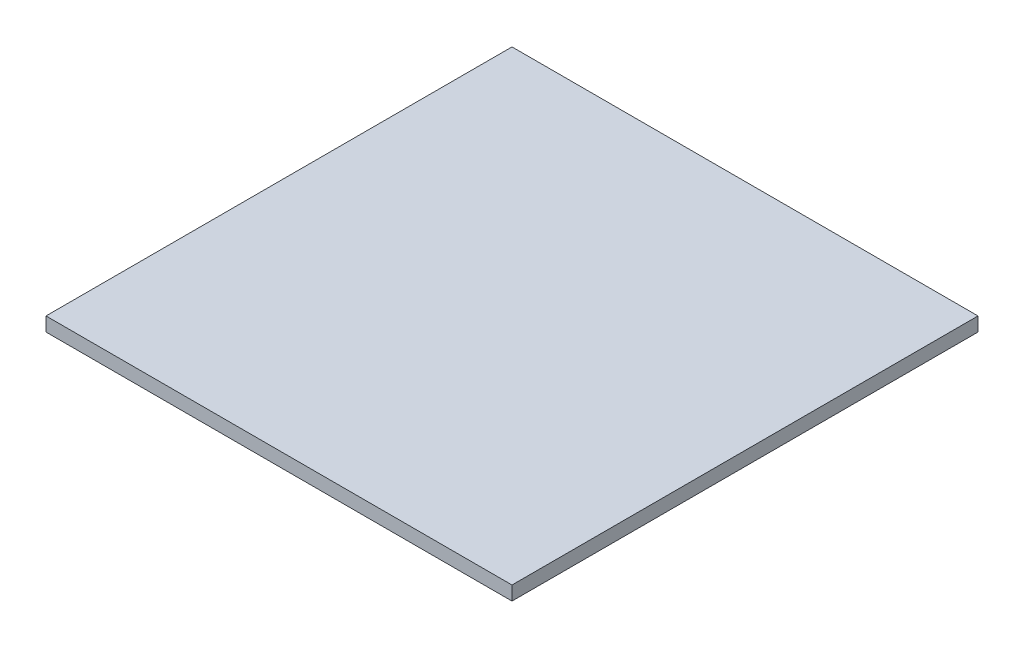
ISO-10303-21;
HEADER;
FILE_DESCRIPTION(('STEP AP214'),'2;1');
FILE_NAME('part.step','',(''),(''),'','','');
FILE_SCHEMA(('AUTOMOTIVE_DESIGN { 1 0 10303 214 1 1 1 1 }'));
ENDSEC;
DATA;
#1=APPLICATION_CONTEXT('core data for automotive mechanical design processes');
#2=APPLICATION_PROTOCOL_DEFINITION('international standard','automotive_design',2000,#1);
#3=PRODUCT_CONTEXT('',#1,'mechanical');
#4=PRODUCT('Part','Part','',(#3));
#5=PRODUCT_RELATED_PRODUCT_CATEGORY('part','',(#4));
#6=PRODUCT_DEFINITION_FORMATION('','',#4);
#7=PRODUCT_DEFINITION_CONTEXT('part definition',#1,'design');
#8=PRODUCT_DEFINITION('design','',#6,#7);
#9=PRODUCT_DEFINITION_SHAPE('','',#8);
#10=(LENGTH_UNIT() NAMED_UNIT(*) SI_UNIT(.MILLI.,.METRE.));
#11=(NAMED_UNIT(*) PLANE_ANGLE_UNIT() SI_UNIT($,.RADIAN.));
#12=(NAMED_UNIT(*) SI_UNIT($,.STERADIAN.) SOLID_ANGLE_UNIT());
#13=UNCERTAINTY_MEASURE_WITH_UNIT(LENGTH_MEASURE(1.E-05),#10,'distance_accuracy_value','');
#14=(GEOMETRIC_REPRESENTATION_CONTEXT(3) GLOBAL_UNCERTAINTY_ASSIGNED_CONTEXT((#13)) GLOBAL_UNIT_ASSIGNED_CONTEXT((#10,
#11,#12)) REPRESENTATION_CONTEXT('',''));
#15=CARTESIAN_POINT('',(0.,0.,0.));
#16=DIRECTION('',(0.,0.,1.));
#17=DIRECTION('',(1.,0.,0.));
#18=AXIS2_PLACEMENT_3D('',#15,#16,#17);
#19=CARTESIAN_POINT('',(-29.6545,1.778,29.6545));
#20=DIRECTION('',(1.,0.,0.));
#21=DIRECTION('',(0.,0.,-1.));
#22=AXIS2_PLACEMENT_3D('',#19,#20,#21);
#23=PLANE('',#22);
#24=DIRECTION('',(0.,0.,1.));
#25=VECTOR('',#24,1.);
#26=CARTESIAN_POINT('',(-29.6545,0.,29.6545));
#27=LINE('',#26,#25);
#28=CARTESIAN_POINT('',(-29.6545,0.,-29.6545));
#29=VERTEX_POINT('',#28);
#30=CARTESIAN_POINT('',(-29.6545,0.,29.6545));
#31=VERTEX_POINT('',#30);
#32=EDGE_CURVE('E111',#29,#31,#27,.T.);
#33=ORIENTED_EDGE('',*,*,#32,.T.);
#34=DIRECTION('',(0.,-1.,0.));
#35=VECTOR('',#34,1.);
#36=CARTESIAN_POINT('',(-29.6545,1.778,29.6545));
#37=LINE('',#36,#35);
#38=CARTESIAN_POINT('',(-29.6545,1.778,29.6545));
#39=VERTEX_POINT('',#38);
#40=EDGE_CURVE('E11',#39,#31,#37,.T.);
#41=ORIENTED_EDGE('',*,*,#40,.F.);
#42=DIRECTION('',(0.,0.,1.));
#43=VECTOR('',#42,1.);
#44=CARTESIAN_POINT('',(-29.6545,1.778,29.6545));
#45=LINE('',#44,#43);
#46=CARTESIAN_POINT('',(-29.6545,1.778,-29.6545));
#47=VERTEX_POINT('',#46);
#48=EDGE_CURVE('E95',#47,#39,#45,.T.);
#49=ORIENTED_EDGE('',*,*,#48,.F.);
#50=DIRECTION('',(0.,-1.,0.));
#51=VECTOR('',#50,1.);
#52=CARTESIAN_POINT('',(-29.6545,1.778,-29.6545));
#53=LINE('',#52,#51);
#54=EDGE_CURVE('E107',#47,#29,#53,.T.);
#55=ORIENTED_EDGE('',*,*,#54,.T.);
#56=EDGE_LOOP('',(#33,#41,#49,#55));
#57=FACE_BOUND('',#56,.T.);
#58=ADVANCED_FACE('F43',(#57),#23,.F.);
#59=CARTESIAN_POINT('',(-29.6545,1.778,29.6545));
#60=DIRECTION('',(0.,0.,-1.));
#61=DIRECTION('',(-1.,0.,0.));
#62=AXIS2_PLACEMENT_3D('',#59,#60,#61);
#63=PLANE('',#62);
#64=DIRECTION('',(1.,0.,0.));
#65=VECTOR('',#64,1.);
#66=CARTESIAN_POINT('',(-29.6545,0.,29.6545));
#67=LINE('',#66,#65);
#68=CARTESIAN_POINT('',(29.6545,0.,29.6545));
#69=VERTEX_POINT('',#68);
#70=EDGE_CURVE('E100',#31,#69,#67,.T.);
#71=ORIENTED_EDGE('',*,*,#70,.T.);
#72=DIRECTION('',(0.,-1.,0.));
#73=VECTOR('',#72,1.);
#74=CARTESIAN_POINT('',(29.6545,1.778,29.6545));
#75=LINE('',#74,#73);
#76=CARTESIAN_POINT('',(29.6545,1.778,29.6545));
#77=VERTEX_POINT('',#76);
#78=EDGE_CURVE('E52',#77,#69,#75,.T.);
#79=ORIENTED_EDGE('',*,*,#78,.F.);
#80=DIRECTION('',(1.,0.,0.));
#81=VECTOR('',#80,1.);
#82=CARTESIAN_POINT('',(-29.6545,1.778,29.6545));
#83=LINE('',#82,#81);
#84=EDGE_CURVE('E90',#39,#77,#83,.T.);
#85=ORIENTED_EDGE('',*,*,#84,.F.);
#86=ORIENTED_EDGE('',*,*,#40,.T.);
#87=EDGE_LOOP('',(#71,#79,#85,#86));
#88=FACE_BOUND('',#87,.T.);
#89=ADVANCED_FACE('F99',(#88),#63,.F.);
#90=CARTESIAN_POINT('',(29.6545,1.778,29.6545));
#91=DIRECTION('',(-1.,0.,0.));
#92=DIRECTION('',(0.,0.,1.));
#93=AXIS2_PLACEMENT_3D('',#90,#91,#92);
#94=PLANE('',#93);
#95=DIRECTION('',(0.,0.,-1.));
#96=VECTOR('',#95,1.);
#97=CARTESIAN_POINT('',(29.6545,0.,29.6545));
#98=LINE('',#97,#96);
#99=CARTESIAN_POINT('',(29.6545,0.,-29.6545));
#100=VERTEX_POINT('',#99);
#101=EDGE_CURVE('E77',#69,#100,#98,.T.);
#102=ORIENTED_EDGE('',*,*,#101,.T.);
#103=DIRECTION('',(0.,-1.,0.));
#104=VECTOR('',#103,1.);
#105=CARTESIAN_POINT('',(29.6545,1.778,-29.6545));
#106=LINE('',#105,#104);
#107=CARTESIAN_POINT('',(29.6545,1.778,-29.6545));
#108=VERTEX_POINT('',#107);
#109=EDGE_CURVE('E102',#108,#100,#106,.T.);
#110=ORIENTED_EDGE('',*,*,#109,.F.);
#111=DIRECTION('',(0.,0.,-1.));
#112=VECTOR('',#111,1.);
#113=CARTESIAN_POINT('',(29.6545,1.778,29.6545));
#114=LINE('',#113,#112);
#115=EDGE_CURVE('E93',#77,#108,#114,.T.);
#116=ORIENTED_EDGE('',*,*,#115,.F.);
#117=ORIENTED_EDGE('',*,*,#78,.T.);
#118=EDGE_LOOP('',(#102,#110,#116,#117));
#119=FACE_BOUND('',#118,.T.);
#120=ADVANCED_FACE('F103',(#119),#94,.F.);
#121=CARTESIAN_POINT('',(-29.6545,1.778,-29.6545));
#122=DIRECTION('',(0.,0.,1.));
#123=DIRECTION('',(1.,0.,0.));
#124=AXIS2_PLACEMENT_3D('',#121,#122,#123);
#125=PLANE('',#124);
#126=DIRECTION('',(-1.,0.,0.));
#127=VECTOR('',#126,1.);
#128=CARTESIAN_POINT('',(-29.6545,0.,-29.6545));
#129=LINE('',#128,#127);
#130=EDGE_CURVE('E83',#100,#29,#129,.T.);
#131=ORIENTED_EDGE('',*,*,#130,.T.);
#132=ORIENTED_EDGE('',*,*,#54,.F.);
#133=DIRECTION('',(-1.,0.,0.));
#134=VECTOR('',#133,1.);
#135=CARTESIAN_POINT('',(-29.6545,1.778,-29.6545));
#136=LINE('',#135,#134);
#137=EDGE_CURVE('E60',#108,#47,#136,.T.);
#138=ORIENTED_EDGE('',*,*,#137,.F.);
#139=ORIENTED_EDGE('',*,*,#109,.T.);
#140=EDGE_LOOP('',(#131,#132,#138,#139));
#141=FACE_BOUND('',#140,.T.);
#142=ADVANCED_FACE('F124',(#141),#125,.F.);
#143=CARTESIAN_POINT('',(0.,1.778,0.));
#144=DIRECTION('',(0.,-1.,0.));
#145=DIRECTION('',(0.,0.,-1.));
#146=AXIS2_PLACEMENT_3D('',#143,#144,#145);
#147=PLANE('',#146);
#148=ORIENTED_EDGE('',*,*,#48,.T.);
#149=ORIENTED_EDGE('',*,*,#84,.T.);
#150=ORIENTED_EDGE('',*,*,#115,.T.);
#151=ORIENTED_EDGE('',*,*,#137,.T.);
#152=EDGE_LOOP('',(#148,#149,#150,#151));
#153=FACE_BOUND('',#152,.T.);
#154=ADVANCED_FACE('F91',(#153),#147,.F.);
#155=CARTESIAN_POINT('',(0.,0.,0.));
#156=DIRECTION('',(0.,-1.,0.));
#157=DIRECTION('',(0.,0.,-1.));
#158=AXIS2_PLACEMENT_3D('',#155,#156,#157);
#159=PLANE('',#158);
#160=ORIENTED_EDGE('',*,*,#32,.F.);
#161=ORIENTED_EDGE('',*,*,#130,.F.);
#162=ORIENTED_EDGE('',*,*,#101,.F.);
#163=ORIENTED_EDGE('',*,*,#70,.F.);
#164=EDGE_LOOP('',(#160,#161,#162,#163));
#165=FACE_BOUND('',#164,.T.);
#166=ADVANCED_FACE('F127',(#165),#159,.T.);
#167=CLOSED_SHELL('',(#58,#89,#120,#142,#154,#166));
#168=MANIFOLD_SOLID_BREP('B2',#167);
#169=ADVANCED_BREP_SHAPE_REPRESENTATION('',(#18,#168),#14);
#170=SHAPE_DEFINITION_REPRESENTATION(#9,#169);
ENDSEC;
END-ISO-10303-21;
